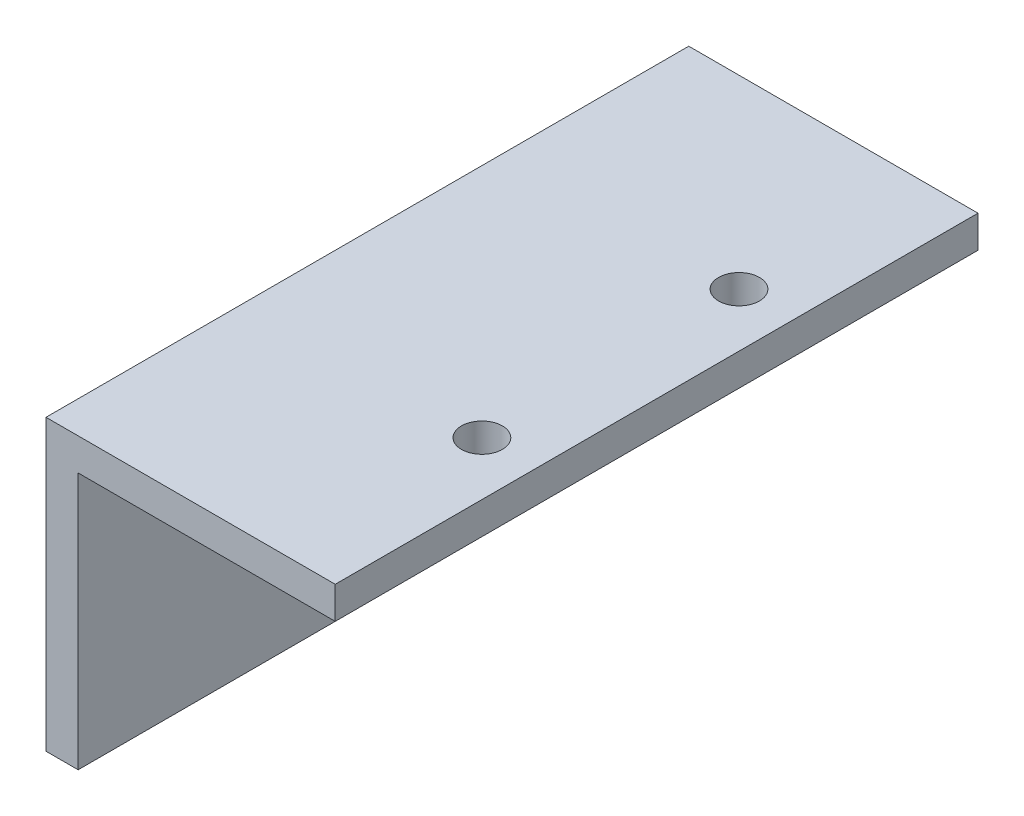
ISO-10303-21;
HEADER;
FILE_DESCRIPTION(('STEP AP214'),'2;1');
FILE_NAME('part.step','',(''),(''),'','','');
FILE_SCHEMA(('AUTOMOTIVE_DESIGN { 1 0 10303 214 1 1 1 1 }'));
ENDSEC;
DATA;
#1=APPLICATION_CONTEXT('core data for automotive mechanical design processes');
#2=APPLICATION_PROTOCOL_DEFINITION('international standard','automotive_design',2000,#1);
#3=PRODUCT_CONTEXT('',#1,'mechanical');
#4=PRODUCT('Part','Part','',(#3));
#5=PRODUCT_RELATED_PRODUCT_CATEGORY('part','',(#4));
#6=PRODUCT_DEFINITION_FORMATION('','',#4);
#7=PRODUCT_DEFINITION_CONTEXT('part definition',#1,'design');
#8=PRODUCT_DEFINITION('design','',#6,#7);
#9=PRODUCT_DEFINITION_SHAPE('','',#8);
#10=(LENGTH_UNIT() NAMED_UNIT(*) SI_UNIT(.MILLI.,.METRE.));
#11=(NAMED_UNIT(*) PLANE_ANGLE_UNIT() SI_UNIT($,.RADIAN.));
#12=(NAMED_UNIT(*) SI_UNIT($,.STERADIAN.) SOLID_ANGLE_UNIT());
#13=UNCERTAINTY_MEASURE_WITH_UNIT(LENGTH_MEASURE(1.E-05),#10,'distance_accuracy_value','');
#14=(GEOMETRIC_REPRESENTATION_CONTEXT(3) GLOBAL_UNCERTAINTY_ASSIGNED_CONTEXT((#13)) GLOBAL_UNIT_ASSIGNED_CONTEXT((#10,
#11,#12)) REPRESENTATION_CONTEXT('',''));
#15=CARTESIAN_POINT('',(0.,0.,0.));
#16=DIRECTION('',(0.,0.,1.));
#17=DIRECTION('',(1.,0.,0.));
#18=AXIS2_PLACEMENT_3D('',#15,#16,#17);
#19=CARTESIAN_POINT('',(0.,0.,63.5));
#20=DIRECTION('',(0.,1.,0.));
#21=DIRECTION('',(0.,0.,1.));
#22=AXIS2_PLACEMENT_3D('',#19,#20,#21);
#23=PLANE('',#22);
#24=DIRECTION('',(1.,0.,0.));
#25=VECTOR('',#24,1.);
#26=CARTESIAN_POINT('',(0.,0.,0.));
#27=LINE('',#26,#25);
#28=CARTESIAN_POINT('',(0.,0.,0.));
#29=VERTEX_POINT('',#28);
#30=CARTESIAN_POINT('',(3.175,0.,0.));
#31=VERTEX_POINT('',#30);
#32=EDGE_CURVE('E117',#29,#31,#27,.T.);
#33=ORIENTED_EDGE('',*,*,#32,.T.);
#34=DIRECTION('',(0.,0.,-1.));
#35=VECTOR('',#34,1.);
#36=CARTESIAN_POINT('',(3.175,0.,63.5));
#37=LINE('',#36,#35);
#38=CARTESIAN_POINT('',(3.175,0.,63.5));
#39=VERTEX_POINT('',#38);
#40=EDGE_CURVE('E11',#39,#31,#37,.T.);
#41=ORIENTED_EDGE('',*,*,#40,.F.);
#42=DIRECTION('',(1.,0.,0.));
#43=VECTOR('',#42,1.);
#44=CARTESIAN_POINT('',(0.,0.,63.5));
#45=LINE('',#44,#43);
#46=CARTESIAN_POINT('',(0.,0.,63.5));
#47=VERTEX_POINT('',#46);
#48=EDGE_CURVE('E128',#47,#39,#45,.T.);
#49=ORIENTED_EDGE('',*,*,#48,.F.);
#50=DIRECTION('',(0.,0.,-1.));
#51=VECTOR('',#50,1.);
#52=CARTESIAN_POINT('',(0.,0.,63.5));
#53=LINE('',#52,#51);
#54=EDGE_CURVE('E113',#47,#29,#53,.T.);
#55=ORIENTED_EDGE('',*,*,#54,.T.);
#56=EDGE_LOOP('',(#33,#41,#49,#55));
#57=FACE_BOUND('',#56,.T.);
#58=ADVANCED_FACE('F33',(#57),#23,.F.);
#59=CARTESIAN_POINT('',(3.175,0.,63.5));
#60=DIRECTION('',(-1.,0.,0.));
#61=DIRECTION('',(0.,0.,1.));
#62=AXIS2_PLACEMENT_3D('',#59,#60,#61);
#63=PLANE('',#62);
#64=DIRECTION('',(0.,1.,0.));
#65=VECTOR('',#64,1.);
#66=CARTESIAN_POINT('',(3.175,0.,0.));
#67=LINE('',#66,#65);
#68=CARTESIAN_POINT('',(3.175,25.4,0.));
#69=VERTEX_POINT('',#68);
#70=EDGE_CURVE('E120',#31,#69,#67,.T.);
#71=ORIENTED_EDGE('',*,*,#70,.T.);
#72=DIRECTION('',(0.,0.,-1.));
#73=VECTOR('',#72,1.);
#74=CARTESIAN_POINT('',(3.175,25.4,63.5));
#75=LINE('',#74,#73);
#76=CARTESIAN_POINT('',(3.175,25.4,63.5));
#77=VERTEX_POINT('',#76);
#78=EDGE_CURVE('E41',#77,#69,#75,.T.);
#79=ORIENTED_EDGE('',*,*,#78,.F.);
#80=DIRECTION('',(0.,1.,0.));
#81=VECTOR('',#80,1.);
#82=CARTESIAN_POINT('',(3.175,0.,63.5));
#83=LINE('',#82,#81);
#84=EDGE_CURVE('E86',#39,#77,#83,.T.);
#85=ORIENTED_EDGE('',*,*,#84,.F.);
#86=ORIENTED_EDGE('',*,*,#40,.T.);
#87=EDGE_LOOP('',(#71,#79,#85,#86));
#88=FACE_BOUND('',#87,.T.);
#89=ADVANCED_FACE('F153',(#88),#63,.F.);
#90=CARTESIAN_POINT('',(3.175,25.4,63.5));
#91=DIRECTION('',(0.,1.,0.));
#92=DIRECTION('',(0.,0.,1.));
#93=AXIS2_PLACEMENT_3D('',#90,#91,#92);
#94=PLANE('',#93);
#95=CARTESIAN_POINT('',(23.275,25.4,18.3102460932157));
#96=DIRECTION('',(0.,1.,0.));
#97=DIRECTION('',(0.,0.,1.));
#98=AXIS2_PLACEMENT_3D('',#95,#96,#97);
#99=CIRCLE('',#98,2.01929999999999);
#100=CARTESIAN_POINT('',(23.275,25.4,20.3295460932156));
#101=VERTEX_POINT('',#100);
#102=EDGE_CURVE('E221',#101,#101,#99,.F.);
#103=ORIENTED_EDGE('',*,*,#102,.F.);
#104=EDGE_LOOP('',(#103));
#105=FACE_BOUND('',#104,.T.);
#106=CARTESIAN_POINT('',(23.275,25.4,43.7102460932157));
#107=DIRECTION('',(0.,1.,0.));
#108=DIRECTION('',(0.,0.,1.));
#109=AXIS2_PLACEMENT_3D('',#106,#107,#108);
#110=CIRCLE('',#109,2.01929999999999);
#111=CARTESIAN_POINT('',(23.275,25.4,45.7295460932157));
#112=VERTEX_POINT('',#111);
#113=EDGE_CURVE('E121',#112,#112,#110,.F.);
#114=ORIENTED_EDGE('',*,*,#113,.F.);
#115=EDGE_LOOP('',(#114));
#116=FACE_BOUND('',#115,.T.);
#117=DIRECTION('',(1.,0.,0.));
#118=VECTOR('',#117,1.);
#119=CARTESIAN_POINT('',(3.175,25.4,0.));
#120=LINE('',#119,#118);
#121=CARTESIAN_POINT('',(28.575,25.4,0.));
#122=VERTEX_POINT('',#121);
#123=EDGE_CURVE('E123',#69,#122,#120,.T.);
#124=ORIENTED_EDGE('',*,*,#123,.T.);
#125=DIRECTION('',(0.,0.,-1.));
#126=VECTOR('',#125,1.);
#127=CARTESIAN_POINT('',(28.575,25.4,63.5));
#128=LINE('',#127,#126);
#129=CARTESIAN_POINT('',(28.575,25.4,63.5));
#130=VERTEX_POINT('',#129);
#131=EDGE_CURVE('E108',#130,#122,#128,.T.);
#132=ORIENTED_EDGE('',*,*,#131,.F.);
#133=DIRECTION('',(1.,0.,0.));
#134=VECTOR('',#133,1.);
#135=CARTESIAN_POINT('',(3.175,25.4,63.5));
#136=LINE('',#135,#134);
#137=EDGE_CURVE('E99',#77,#130,#136,.T.);
#138=ORIENTED_EDGE('',*,*,#137,.F.);
#139=ORIENTED_EDGE('',*,*,#78,.T.);
#140=EDGE_LOOP('',(#124,#132,#138,#139));
#141=FACE_BOUND('',#140,.T.);
#142=ADVANCED_FACE('F134',(#105,#116,#141),#94,.F.);
#143=CARTESIAN_POINT('',(28.575,28.575,63.5));
#144=DIRECTION('',(-1.,0.,0.));
#145=DIRECTION('',(0.,0.,1.));
#146=AXIS2_PLACEMENT_3D('',#143,#144,#145);
#147=PLANE('',#146);
#148=DIRECTION('',(0.,1.,0.));
#149=VECTOR('',#148,1.);
#150=CARTESIAN_POINT('',(28.575,28.575,0.));
#151=LINE('',#150,#149);
#152=CARTESIAN_POINT('',(28.575,28.575,0.));
#153=VERTEX_POINT('',#152);
#154=EDGE_CURVE('E107',#122,#153,#151,.T.);
#155=ORIENTED_EDGE('',*,*,#154,.T.);
#156=DIRECTION('',(0.,0.,-1.));
#157=VECTOR('',#156,1.);
#158=CARTESIAN_POINT('',(28.575,28.575,63.5));
#159=LINE('',#158,#157);
#160=CARTESIAN_POINT('',(28.575,28.575,63.5));
#161=VERTEX_POINT('',#160);
#162=EDGE_CURVE('E104',#161,#153,#159,.T.);
#163=ORIENTED_EDGE('',*,*,#162,.F.);
#164=DIRECTION('',(0.,1.,0.));
#165=VECTOR('',#164,1.);
#166=CARTESIAN_POINT('',(28.575,28.575,63.5));
#167=LINE('',#166,#165);
#168=EDGE_CURVE('E93',#130,#161,#167,.T.);
#169=ORIENTED_EDGE('',*,*,#168,.F.);
#170=ORIENTED_EDGE('',*,*,#131,.T.);
#171=EDGE_LOOP('',(#155,#163,#169,#170));
#172=FACE_BOUND('',#171,.T.);
#173=ADVANCED_FACE('F105',(#172),#147,.F.);
#174=CARTESIAN_POINT('',(0.,28.575,63.5));
#175=DIRECTION('',(0.,-1.,0.));
#176=DIRECTION('',(0.,0.,-1.));
#177=AXIS2_PLACEMENT_3D('',#174,#175,#176);
#178=PLANE('',#177);
#179=CARTESIAN_POINT('',(23.275,28.575,18.3102460932157));
#180=DIRECTION('',(0.,1.,0.));
#181=DIRECTION('',(0.,0.,1.));
#182=AXIS2_PLACEMENT_3D('',#179,#180,#181);
#183=CIRCLE('',#182,2.01929999999999);
#184=CARTESIAN_POINT('',(23.275,28.575,20.3295460932156));
#185=VERTEX_POINT('',#184);
#186=EDGE_CURVE('E218',#185,#185,#183,.T.);
#187=ORIENTED_EDGE('',*,*,#186,.F.);
#188=EDGE_LOOP('',(#187));
#189=FACE_BOUND('',#188,.T.);
#190=CARTESIAN_POINT('',(23.275,28.575,43.7102460932157));
#191=DIRECTION('',(0.,1.,0.));
#192=DIRECTION('',(0.,0.,1.));
#193=AXIS2_PLACEMENT_3D('',#190,#191,#192);
#194=CIRCLE('',#193,2.01929999999999);
#195=CARTESIAN_POINT('',(23.275,28.575,45.7295460932157));
#196=VERTEX_POINT('',#195);
#197=EDGE_CURVE('E222',#196,#196,#194,.T.);
#198=ORIENTED_EDGE('',*,*,#197,.F.);
#199=EDGE_LOOP('',(#198));
#200=FACE_BOUND('',#199,.T.);
#201=DIRECTION('',(-1.,0.,0.));
#202=VECTOR('',#201,1.);
#203=CARTESIAN_POINT('',(0.,28.575,0.));
#204=LINE('',#203,#202);
#205=CARTESIAN_POINT('',(0.,28.575,0.));
#206=VERTEX_POINT('',#205);
#207=EDGE_CURVE('E72',#153,#206,#204,.T.);
#208=ORIENTED_EDGE('',*,*,#207,.T.);
#209=DIRECTION('',(0.,0.,-1.));
#210=VECTOR('',#209,1.);
#211=CARTESIAN_POINT('',(0.,28.575,63.5));
#212=LINE('',#211,#210);
#213=CARTESIAN_POINT('',(0.,28.575,63.5));
#214=VERTEX_POINT('',#213);
#215=EDGE_CURVE('E109',#214,#206,#212,.T.);
#216=ORIENTED_EDGE('',*,*,#215,.F.);
#217=DIRECTION('',(-1.,0.,0.));
#218=VECTOR('',#217,1.);
#219=CARTESIAN_POINT('',(0.,28.575,63.5));
#220=LINE('',#219,#218);
#221=EDGE_CURVE('E97',#161,#214,#220,.T.);
#222=ORIENTED_EDGE('',*,*,#221,.F.);
#223=ORIENTED_EDGE('',*,*,#162,.T.);
#224=EDGE_LOOP('',(#208,#216,#222,#223));
#225=FACE_BOUND('',#224,.T.);
#226=ADVANCED_FACE('F111',(#189,#200,#225),#178,.F.);
#227=CARTESIAN_POINT('',(0.,0.,63.5));
#228=DIRECTION('',(1.,0.,0.));
#229=DIRECTION('',(0.,0.,-1.));
#230=AXIS2_PLACEMENT_3D('',#227,#228,#229);
#231=PLANE('',#230);
#232=DIRECTION('',(0.,-1.,0.));
#233=VECTOR('',#232,1.);
#234=CARTESIAN_POINT('',(0.,0.,0.));
#235=LINE('',#234,#233);
#236=EDGE_CURVE('E78',#206,#29,#235,.T.);
#237=ORIENTED_EDGE('',*,*,#236,.T.);
#238=ORIENTED_EDGE('',*,*,#54,.F.);
#239=DIRECTION('',(0.,-1.,0.));
#240=VECTOR('',#239,1.);
#241=CARTESIAN_POINT('',(0.,0.,63.5));
#242=LINE('',#241,#240);
#243=EDGE_CURVE('E49',#214,#47,#242,.T.);
#244=ORIENTED_EDGE('',*,*,#243,.F.);
#245=ORIENTED_EDGE('',*,*,#215,.T.);
#246=EDGE_LOOP('',(#237,#238,#244,#245));
#247=FACE_BOUND('',#246,.T.);
#248=ADVANCED_FACE('F141',(#247),#231,.F.);
#249=CARTESIAN_POINT('',(0.,0.,63.5));
#250=DIRECTION('',(0.,0.,1.));
#251=DIRECTION('',(1.,0.,0.));
#252=AXIS2_PLACEMENT_3D('',#249,#250,#251);
#253=PLANE('',#252);
#254=ORIENTED_EDGE('',*,*,#48,.T.);
#255=ORIENTED_EDGE('',*,*,#84,.T.);
#256=ORIENTED_EDGE('',*,*,#137,.T.);
#257=ORIENTED_EDGE('',*,*,#168,.T.);
#258=ORIENTED_EDGE('',*,*,#221,.T.);
#259=ORIENTED_EDGE('',*,*,#243,.T.);
#260=EDGE_LOOP('',(#254,#255,#256,#257,#258,#259));
#261=FACE_BOUND('',#260,.T.);
#262=ADVANCED_FACE('F95',(#261),#253,.T.);
#263=CARTESIAN_POINT('',(0.,0.,0.));
#264=DIRECTION('',(0.,0.,1.));
#265=DIRECTION('',(1.,0.,0.));
#266=AXIS2_PLACEMENT_3D('',#263,#264,#265);
#267=PLANE('',#266);
#268=ORIENTED_EDGE('',*,*,#32,.F.);
#269=ORIENTED_EDGE('',*,*,#236,.F.);
#270=ORIENTED_EDGE('',*,*,#207,.F.);
#271=ORIENTED_EDGE('',*,*,#154,.F.);
#272=ORIENTED_EDGE('',*,*,#123,.F.);
#273=ORIENTED_EDGE('',*,*,#70,.F.);
#274=EDGE_LOOP('',(#268,#269,#270,#271,#272,#273));
#275=FACE_BOUND('',#274,.T.);
#276=ADVANCED_FACE('F137',(#275),#267,.F.);
#277=CARTESIAN_POINT('',(23.275,-0.001000000000001,43.7102460932157));
#278=DIRECTION('',(0.,1.,0.));
#279=DIRECTION('',(0.,0.,1.));
#280=AXIS2_PLACEMENT_3D('',#277,#278,#279);
#281=CYLINDRICAL_SURFACE('',#280,2.01929999999999);
#282=ORIENTED_EDGE('',*,*,#197,.T.);
#283=EDGE_LOOP('',(#282));
#284=FACE_BOUND('',#283,.T.);
#285=ORIENTED_EDGE('',*,*,#113,.T.);
#286=EDGE_LOOP('',(#285));
#287=FACE_BOUND('',#286,.T.);
#288=ADVANCED_FACE('F181',(#284,#287),#281,.F.);
#289=CARTESIAN_POINT('',(23.275,-0.001000000000001,18.3102460932157));
#290=DIRECTION('',(0.,1.,0.));
#291=DIRECTION('',(0.,0.,1.));
#292=AXIS2_PLACEMENT_3D('',#289,#290,#291);
#293=CYLINDRICAL_SURFACE('',#292,2.01929999999999);
#294=ORIENTED_EDGE('',*,*,#186,.T.);
#295=EDGE_LOOP('',(#294));
#296=FACE_BOUND('',#295,.T.);
#297=ORIENTED_EDGE('',*,*,#102,.T.);
#298=EDGE_LOOP('',(#297));
#299=FACE_BOUND('',#298,.T.);
#300=ADVANCED_FACE('F186',(#296,#299),#293,.F.);
#301=CLOSED_SHELL('',(#58,#89,#142,#173,#226,#248,#262,#276,#288,#300));
#302=MANIFOLD_SOLID_BREP('B2',#301);
#303=ADVANCED_BREP_SHAPE_REPRESENTATION('',(#18,#302),#14);
#304=SHAPE_DEFINITION_REPRESENTATION(#9,#303);
ENDSEC;
END-ISO-10303-21;
